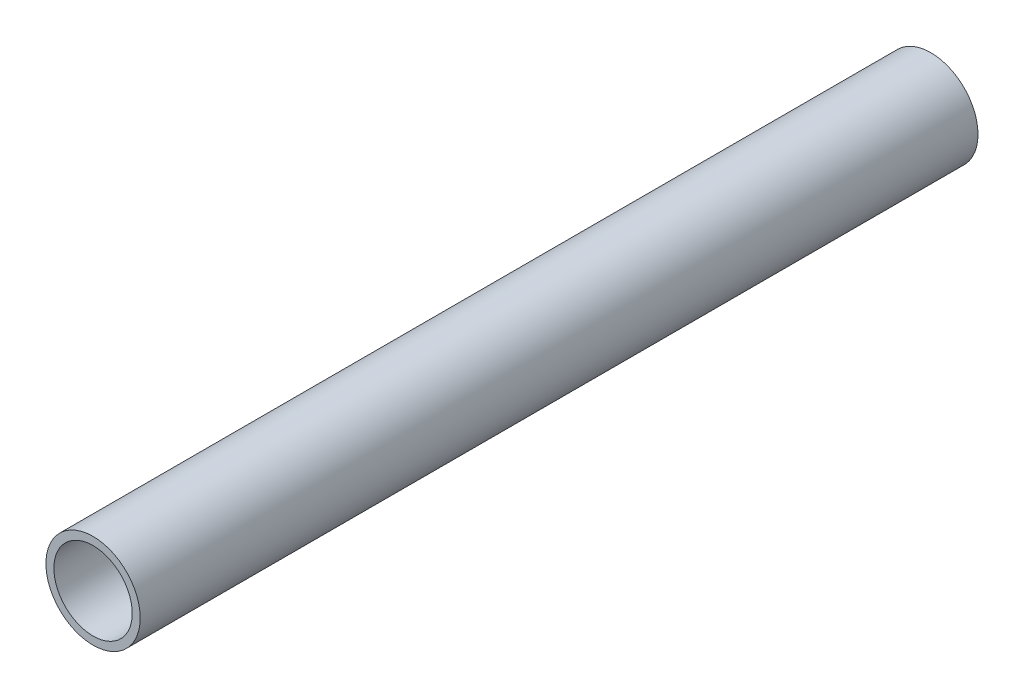
ISO-10303-21;
HEADER;
FILE_DESCRIPTION(('STEP AP214'),'2;1');
FILE_NAME('part.step','',(''),(''),'','','');
FILE_SCHEMA(('AUTOMOTIVE_DESIGN { 1 0 10303 214 1 1 1 1 }'));
ENDSEC;
DATA;
#1=APPLICATION_CONTEXT('core data for automotive mechanical design processes');
#2=APPLICATION_PROTOCOL_DEFINITION('international standard','automotive_design',2000,#1);
#3=PRODUCT_CONTEXT('',#1,'mechanical');
#4=PRODUCT('Part','Part','',(#3));
#5=PRODUCT_RELATED_PRODUCT_CATEGORY('part','',(#4));
#6=PRODUCT_DEFINITION_FORMATION('','',#4);
#7=PRODUCT_DEFINITION_CONTEXT('part definition',#1,'design');
#8=PRODUCT_DEFINITION('design','',#6,#7);
#9=PRODUCT_DEFINITION_SHAPE('','',#8);
#10=(LENGTH_UNIT() NAMED_UNIT(*) SI_UNIT(.MILLI.,.METRE.));
#11=(NAMED_UNIT(*) PLANE_ANGLE_UNIT() SI_UNIT($,.RADIAN.));
#12=(NAMED_UNIT(*) SI_UNIT($,.STERADIAN.) SOLID_ANGLE_UNIT());
#13=UNCERTAINTY_MEASURE_WITH_UNIT(LENGTH_MEASURE(1.E-05),#10,'distance_accuracy_value','');
#14=(GEOMETRIC_REPRESENTATION_CONTEXT(3) GLOBAL_UNCERTAINTY_ASSIGNED_CONTEXT((#13)) GLOBAL_UNIT_ASSIGNED_CONTEXT((#10,
#11,#12)) REPRESENTATION_CONTEXT('',''));
#15=CARTESIAN_POINT('',(0.,0.,0.));
#16=DIRECTION('',(0.,0.,1.));
#17=DIRECTION('',(1.,0.,0.));
#18=AXIS2_PLACEMENT_3D('',#15,#16,#17);
#19=CARTESIAN_POINT('',(0.,0.,0.));
#20=DIRECTION('',(0.,0.,1.));
#21=DIRECTION('',(1.,0.,0.));
#22=AXIS2_PLACEMENT_3D('',#19,#20,#21);
#23=CYLINDRICAL_SURFACE('',#22,17.526);
#24=CARTESIAN_POINT('',(0.,0.,374.65));
#25=DIRECTION('',(0.,0.,1.));
#26=DIRECTION('',(1.,0.,0.));
#27=AXIS2_PLACEMENT_3D('',#24,#25,#26);
#28=CIRCLE('',#27,17.526);
#29=CARTESIAN_POINT('',(17.526,0.,374.65));
#30=VERTEX_POINT('',#29);
#31=EDGE_CURVE('E18',#30,#30,#28,.F.);
#32=ORIENTED_EDGE('',*,*,#31,.F.);
#33=EDGE_LOOP('',(#32));
#34=FACE_BOUND('',#33,.T.);
#35=CARTESIAN_POINT('',(0.,0.,0.));
#36=DIRECTION('',(0.,0.,1.));
#37=DIRECTION('',(1.,0.,0.));
#38=AXIS2_PLACEMENT_3D('',#35,#36,#37);
#39=CIRCLE('',#38,17.526);
#40=CARTESIAN_POINT('',(17.526,0.,0.));
#41=VERTEX_POINT('',#40);
#42=EDGE_CURVE('E27',#41,#41,#39,.F.);
#43=ORIENTED_EDGE('',*,*,#42,.T.);
#44=EDGE_LOOP('',(#43));
#45=FACE_BOUND('',#44,.T.);
#46=ADVANCED_FACE('F15',(#34,#45),#23,.F.);
#47=CARTESIAN_POINT('',(0.,0.,374.65));
#48=DIRECTION('',(0.,0.,1.));
#49=DIRECTION('',(1.,0.,0.));
#50=AXIS2_PLACEMENT_3D('',#47,#48,#49);
#51=PLANE('',#50);
#52=ORIENTED_EDGE('',*,*,#31,.T.);
#53=EDGE_LOOP('',(#52));
#54=FACE_BOUND('',#53,.T.);
#55=CARTESIAN_POINT('',(0.,0.,374.65));
#56=DIRECTION('',(0.,0.,1.));
#57=DIRECTION('',(1.,0.,0.));
#58=AXIS2_PLACEMENT_3D('',#55,#56,#57);
#59=CIRCLE('',#58,21.082);
#60=CARTESIAN_POINT('',(21.082,0.,374.65));
#61=VERTEX_POINT('',#60);
#62=EDGE_CURVE('E22',#61,#61,#59,.F.);
#63=ORIENTED_EDGE('',*,*,#62,.F.);
#64=EDGE_LOOP('',(#63));
#65=FACE_BOUND('',#64,.T.);
#66=ADVANCED_FACE('F35',(#54,#65),#51,.T.);
#67=CARTESIAN_POINT('',(0.,0.,0.));
#68=DIRECTION('',(0.,0.,1.));
#69=DIRECTION('',(1.,0.,0.));
#70=AXIS2_PLACEMENT_3D('',#67,#68,#69);
#71=PLANE('',#70);
#72=ORIENTED_EDGE('',*,*,#42,.F.);
#73=EDGE_LOOP('',(#72));
#74=FACE_BOUND('',#73,.T.);
#75=CARTESIAN_POINT('',(0.,0.,0.));
#76=DIRECTION('',(0.,0.,1.));
#77=DIRECTION('',(1.,0.,0.));
#78=AXIS2_PLACEMENT_3D('',#75,#76,#77);
#79=CIRCLE('',#78,21.082);
#80=CARTESIAN_POINT('',(21.082,0.,0.));
#81=VERTEX_POINT('',#80);
#82=EDGE_CURVE('E10',#81,#81,#79,.T.);
#83=ORIENTED_EDGE('',*,*,#82,.F.);
#84=EDGE_LOOP('',(#83));
#85=FACE_BOUND('',#84,.T.);
#86=ADVANCED_FACE('F43',(#74,#85),#71,.F.);
#87=CARTESIAN_POINT('',(0.,0.,0.));
#88=DIRECTION('',(0.,0.,1.));
#89=DIRECTION('',(1.,0.,0.));
#90=AXIS2_PLACEMENT_3D('',#87,#88,#89);
#91=CYLINDRICAL_SURFACE('',#90,21.082);
#92=ORIENTED_EDGE('',*,*,#62,.T.);
#93=EDGE_LOOP('',(#92));
#94=FACE_BOUND('',#93,.T.);
#95=ORIENTED_EDGE('',*,*,#82,.T.);
#96=EDGE_LOOP('',(#95));
#97=FACE_BOUND('',#96,.T.);
#98=ADVANCED_FACE('F44',(#94,#97),#91,.T.);
#99=CLOSED_SHELL('',(#46,#66,#86,#98));
#100=MANIFOLD_SOLID_BREP('B1',#99);
#101=ADVANCED_BREP_SHAPE_REPRESENTATION('',(#18,#100),#14);
#102=SHAPE_DEFINITION_REPRESENTATION(#9,#101);
ENDSEC;
END-ISO-10303-21;
